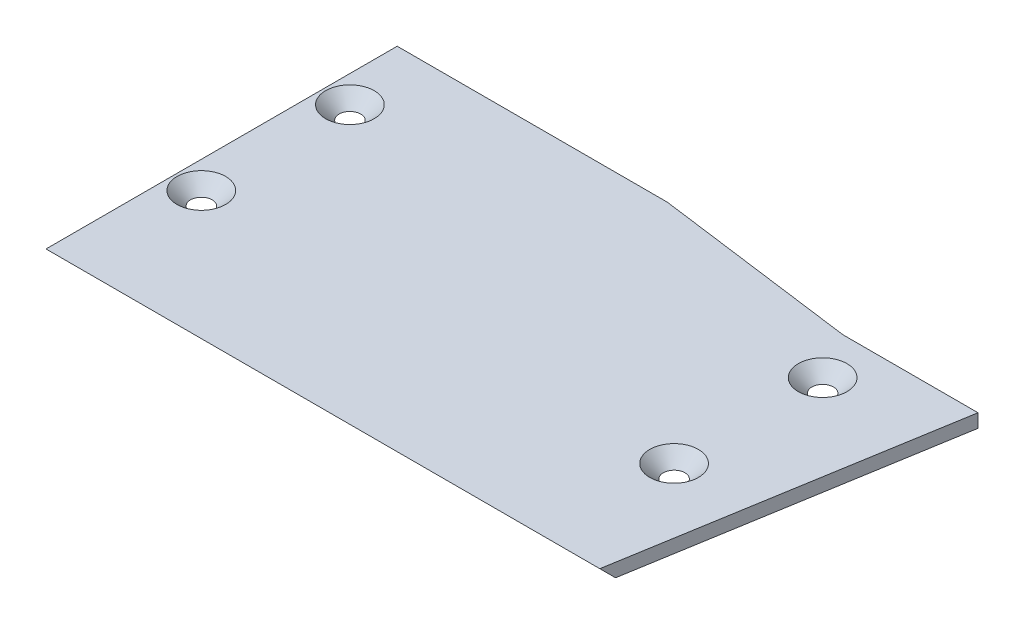
ISO-10303-21;
HEADER;
FILE_DESCRIPTION(('STEP AP214'),'2;1');
FILE_NAME('part.step','',(''),(''),'','','');
FILE_SCHEMA(('AUTOMOTIVE_DESIGN { 1 0 10303 214 1 1 1 1 }'));
ENDSEC;
DATA;
#1=APPLICATION_CONTEXT('core data for automotive mechanical design processes');
#2=APPLICATION_PROTOCOL_DEFINITION('international standard','automotive_design',2000,#1);
#3=PRODUCT_CONTEXT('',#1,'mechanical');
#4=PRODUCT('Part','Part','',(#3));
#5=PRODUCT_RELATED_PRODUCT_CATEGORY('part','',(#4));
#6=PRODUCT_DEFINITION_FORMATION('','',#4);
#7=PRODUCT_DEFINITION_CONTEXT('part definition',#1,'design');
#8=PRODUCT_DEFINITION('design','',#6,#7);
#9=PRODUCT_DEFINITION_SHAPE('','',#8);
#10=(LENGTH_UNIT() NAMED_UNIT(*) SI_UNIT(.MILLI.,.METRE.));
#11=(NAMED_UNIT(*) PLANE_ANGLE_UNIT() SI_UNIT($,.RADIAN.));
#12=(NAMED_UNIT(*) SI_UNIT($,.STERADIAN.) SOLID_ANGLE_UNIT());
#13=UNCERTAINTY_MEASURE_WITH_UNIT(LENGTH_MEASURE(1.E-05),#10,'distance_accuracy_value','');
#14=(GEOMETRIC_REPRESENTATION_CONTEXT(3) GLOBAL_UNCERTAINTY_ASSIGNED_CONTEXT((#13)) GLOBAL_UNIT_ASSIGNED_CONTEXT((#10,
#11,#12)) REPRESENTATION_CONTEXT('',''));
#15=CARTESIAN_POINT('',(0.,0.,0.));
#16=DIRECTION('',(0.,0.,1.));
#17=DIRECTION('',(1.,0.,0.));
#18=AXIS2_PLACEMENT_3D('',#15,#16,#17);
#19=CARTESIAN_POINT('',(90.,2.,0.));
#20=DIRECTION('',(-0.986393923832144,0.,-0.164398987305357));
#21=DIRECTION('',(-0.164398987305357,0.,0.986393923832144));
#22=AXIS2_PLACEMENT_3D('',#19,#20,#21);
#23=PLANE('',#22);
#24=DIRECTION('',(0.164398987305357,0.,-0.986393923832144));
#25=VECTOR('',#24,1.);
#26=CARTESIAN_POINT('',(90.,2.,0.));
#27=LINE('',#26,#25);
#28=CARTESIAN_POINT('',(82.,2.,48.));
#29=VERTEX_POINT('',#28);
#30=CARTESIAN_POINT('',(90.,2.,0.));
#31=VERTEX_POINT('',#30);
#32=EDGE_CURVE('E109',#29,#31,#27,.T.);
#33=ORIENTED_EDGE('',*,*,#32,.F.);
#34=DIRECTION('',(0.117041147196131,-0.702246883176784,-0.702246883176783));
#35=VECTOR('',#34,1.);
#36=CARTESIAN_POINT('',(82.,2.,48.));
#37=LINE('',#36,#35);
#38=CARTESIAN_POINT('',(82.3333333333333,0.,46.));
#39=VERTEX_POINT('',#38);
#40=EDGE_CURVE('E59',#29,#39,#37,.T.);
#41=ORIENTED_EDGE('',*,*,#40,.T.);
#42=DIRECTION('',(0.164398987305357,0.,-0.986393923832144));
#43=VECTOR('',#42,1.);
#44=CARTESIAN_POINT('',(90.,0.,0.));
#45=LINE('',#44,#43);
#46=CARTESIAN_POINT('',(90.,0.,0.));
#47=VERTEX_POINT('',#46);
#48=EDGE_CURVE('E120',#39,#47,#45,.T.);
#49=ORIENTED_EDGE('',*,*,#48,.T.);
#50=DIRECTION('',(0.,-1.,0.));
#51=VECTOR('',#50,1.);
#52=CARTESIAN_POINT('',(90.,2.,0.));
#53=LINE('',#52,#51);
#54=EDGE_CURVE('E137',#31,#47,#53,.T.);
#55=ORIENTED_EDGE('',*,*,#54,.F.);
#56=EDGE_LOOP('',(#33,#41,#49,#55));
#57=FACE_BOUND('',#56,.T.);
#58=ADVANCED_FACE('F35',(#57),#23,.F.);
#59=CARTESIAN_POINT('',(70.,2.,0.));
#60=DIRECTION('',(0.,0.,1.));
#61=DIRECTION('',(1.,0.,0.));
#62=AXIS2_PLACEMENT_3D('',#59,#60,#61);
#63=PLANE('',#62);
#64=DIRECTION('',(-1.,0.,0.));
#65=VECTOR('',#64,1.);
#66=CARTESIAN_POINT('',(70.,0.,0.));
#67=LINE('',#66,#65);
#68=CARTESIAN_POINT('',(70.,0.,0.));
#69=VERTEX_POINT('',#68);
#70=EDGE_CURVE('E122',#47,#69,#67,.T.);
#71=ORIENTED_EDGE('',*,*,#70,.T.);
#72=DIRECTION('',(0.,-1.,0.));
#73=VECTOR('',#72,1.);
#74=CARTESIAN_POINT('',(70.,2.,0.));
#75=LINE('',#74,#73);
#76=CARTESIAN_POINT('',(70.,2.,0.));
#77=VERTEX_POINT('',#76);
#78=EDGE_CURVE('E134',#77,#69,#75,.T.);
#79=ORIENTED_EDGE('',*,*,#78,.F.);
#80=DIRECTION('',(-1.,0.,0.));
#81=VECTOR('',#80,1.);
#82=CARTESIAN_POINT('',(70.,2.,0.));
#83=LINE('',#82,#81);
#84=EDGE_CURVE('E111',#31,#77,#83,.T.);
#85=ORIENTED_EDGE('',*,*,#84,.F.);
#86=ORIENTED_EDGE('',*,*,#54,.T.);
#87=EDGE_LOOP('',(#71,#79,#85,#86));
#88=FACE_BOUND('',#87,.T.);
#89=ADVANCED_FACE('F182',(#88),#63,.F.);
#90=CARTESIAN_POINT('',(40.,2.,-4.));
#91=DIRECTION('',(-0.132163720091018,0.,0.991227900682635));
#92=DIRECTION('',(0.991227900682635,0.,0.132163720091018));
#93=AXIS2_PLACEMENT_3D('',#90,#91,#92);
#94=PLANE('',#93);
#95=DIRECTION('',(-0.991227900682635,0.,-0.132163720091018));
#96=VECTOR('',#95,1.);
#97=CARTESIAN_POINT('',(40.,0.,-4.));
#98=LINE('',#97,#96);
#99=CARTESIAN_POINT('',(40.,0.,-4.));
#100=VERTEX_POINT('',#99);
#101=EDGE_CURVE('E125',#69,#100,#98,.T.);
#102=ORIENTED_EDGE('',*,*,#101,.T.);
#103=DIRECTION('',(0.,-1.,0.));
#104=VECTOR('',#103,1.);
#105=CARTESIAN_POINT('',(40.,2.,-4.));
#106=LINE('',#105,#104);
#107=CARTESIAN_POINT('',(40.,2.,-4.));
#108=VERTEX_POINT('',#107);
#109=EDGE_CURVE('E131',#108,#100,#106,.T.);
#110=ORIENTED_EDGE('',*,*,#109,.F.);
#111=DIRECTION('',(-0.991227900682635,0.,-0.132163720091018));
#112=VECTOR('',#111,1.);
#113=CARTESIAN_POINT('',(40.,2.,-4.));
#114=LINE('',#113,#112);
#115=EDGE_CURVE('E116',#77,#108,#114,.T.);
#116=ORIENTED_EDGE('',*,*,#115,.F.);
#117=ORIENTED_EDGE('',*,*,#78,.T.);
#118=EDGE_LOOP('',(#102,#110,#116,#117));
#119=FACE_BOUND('',#118,.T.);
#120=ADVANCED_FACE('F187',(#119),#94,.F.);
#121=CARTESIAN_POINT('',(0.,2.,-4.));
#122=DIRECTION('',(0.,0.,1.));
#123=DIRECTION('',(1.,0.,0.));
#124=AXIS2_PLACEMENT_3D('',#121,#122,#123);
#125=PLANE('',#124);
#126=DIRECTION('',(-1.,0.,0.));
#127=VECTOR('',#126,1.);
#128=CARTESIAN_POINT('',(0.,0.,-4.));
#129=LINE('',#128,#127);
#130=CARTESIAN_POINT('',(0.,0.,-4.));
#131=VERTEX_POINT('',#130);
#132=EDGE_CURVE('E127',#100,#131,#129,.T.);
#133=ORIENTED_EDGE('',*,*,#132,.T.);
#134=DIRECTION('',(0.,-1.,0.));
#135=VECTOR('',#134,1.);
#136=CARTESIAN_POINT('',(0.,2.,-4.));
#137=LINE('',#136,#135);
#138=CARTESIAN_POINT('',(0.,2.,-4.));
#139=VERTEX_POINT('',#138);
#140=EDGE_CURVE('E119',#139,#131,#137,.T.);
#141=ORIENTED_EDGE('',*,*,#140,.F.);
#142=DIRECTION('',(-1.,0.,0.));
#143=VECTOR('',#142,1.);
#144=CARTESIAN_POINT('',(0.,2.,-4.));
#145=LINE('',#144,#143);
#146=EDGE_CURVE('E105',#108,#139,#145,.T.);
#147=ORIENTED_EDGE('',*,*,#146,.F.);
#148=ORIENTED_EDGE('',*,*,#109,.T.);
#149=EDGE_LOOP('',(#133,#141,#147,#148));
#150=FACE_BOUND('',#149,.T.);
#151=ADVANCED_FACE('F226',(#150),#125,.F.);
#152=CARTESIAN_POINT('',(0.,2.,0.));
#153=DIRECTION('',(1.,0.,0.));
#154=DIRECTION('',(0.,0.,-1.));
#155=AXIS2_PLACEMENT_3D('',#152,#153,#154);
#156=PLANE('',#155);
#157=DIRECTION('',(0.,0.,1.));
#158=VECTOR('',#157,1.);
#159=CARTESIAN_POINT('',(0.,0.,0.));
#160=LINE('',#159,#158);
#161=CARTESIAN_POINT('',(0.,0.,46.));
#162=VERTEX_POINT('',#161);
#163=EDGE_CURVE('E95',#131,#162,#160,.T.);
#164=ORIENTED_EDGE('',*,*,#163,.T.);
#165=DIRECTION('',(0.,0.707106781186548,0.707106781186547));
#166=VECTOR('',#165,1.);
#167=CARTESIAN_POINT('',(0.,2.,48.));
#168=LINE('',#167,#166);
#169=CARTESIAN_POINT('',(0.,2.,48.));
#170=VERTEX_POINT('',#169);
#171=EDGE_CURVE('E89',#162,#170,#168,.T.);
#172=ORIENTED_EDGE('',*,*,#171,.T.);
#173=DIRECTION('',(0.,0.,1.));
#174=VECTOR('',#173,1.);
#175=CARTESIAN_POINT('',(0.,2.,48.));
#176=LINE('',#175,#174);
#177=EDGE_CURVE('E93',#139,#170,#176,.T.);
#178=ORIENTED_EDGE('',*,*,#177,.F.);
#179=ORIENTED_EDGE('',*,*,#140,.T.);
#180=EDGE_LOOP('',(#164,#172,#178,#179));
#181=FACE_BOUND('',#180,.T.);
#182=ADVANCED_FACE('F91',(#181),#156,.F.);
#183=CARTESIAN_POINT('',(0.,2.,0.));
#184=DIRECTION('',(0.,-1.,0.));
#185=DIRECTION('',(0.,0.,-1.));
#186=AXIS2_PLACEMENT_3D('',#183,#184,#185);
#187=PLANE('',#186);
#188=CARTESIAN_POINT('',(74.,2.,7.));
#189=DIRECTION('',(0.,-1.,0.));
#190=DIRECTION('',(0.,0.,-1.));
#191=AXIS2_PLACEMENT_3D('',#188,#189,#190);
#192=CIRCLE('',#191,3.60000000000003);
#193=CARTESIAN_POINT('',(74.,2.,3.39999999999997));
#194=VERTEX_POINT('',#193);
#195=EDGE_CURVE('E11',#194,#194,#192,.T.);
#196=ORIENTED_EDGE('',*,*,#195,.T.);
#197=EDGE_LOOP('',(#196));
#198=FACE_BOUND('',#197,.T.);
#199=CARTESIAN_POINT('',(74.,2.,29.));
#200=DIRECTION('',(0.,-1.,0.));
#201=DIRECTION('',(0.,0.,-1.));
#202=AXIS2_PLACEMENT_3D('',#199,#200,#201);
#203=CIRCLE('',#202,3.60000000000003);
#204=CARTESIAN_POINT('',(74.,2.,25.4));
#205=VERTEX_POINT('',#204);
#206=EDGE_CURVE('E44',#205,#205,#203,.T.);
#207=ORIENTED_EDGE('',*,*,#206,.T.);
#208=EDGE_LOOP('',(#207));
#209=FACE_BOUND('',#208,.T.);
#210=CARTESIAN_POINT('',(4.,2.,7.));
#211=DIRECTION('',(0.,-1.,0.));
#212=DIRECTION('',(0.,0.,-1.));
#213=AXIS2_PLACEMENT_3D('',#210,#211,#212);
#214=CIRCLE('',#213,3.60000000000002);
#215=CARTESIAN_POINT('',(4.,2.,3.39999999999998));
#216=VERTEX_POINT('',#215);
#217=EDGE_CURVE('E144',#216,#216,#214,.T.);
#218=ORIENTED_EDGE('',*,*,#217,.T.);
#219=EDGE_LOOP('',(#218));
#220=FACE_BOUND('',#219,.T.);
#221=CARTESIAN_POINT('',(4.00000000000001,2.,29.));
#222=DIRECTION('',(0.,-1.,0.));
#223=DIRECTION('',(0.,0.,-1.));
#224=AXIS2_PLACEMENT_3D('',#221,#222,#223);
#225=CIRCLE('',#224,3.60000000000003);
#226=CARTESIAN_POINT('',(4.00000000000001,2.,25.4));
#227=VERTEX_POINT('',#226);
#228=EDGE_CURVE('E98',#227,#227,#225,.T.);
#229=ORIENTED_EDGE('',*,*,#228,.T.);
#230=EDGE_LOOP('',(#229));
#231=FACE_BOUND('',#230,.T.);
#232=ORIENTED_EDGE('',*,*,#177,.T.);
#233=DIRECTION('',(1.,0.,0.));
#234=VECTOR('',#233,1.);
#235=CARTESIAN_POINT('',(82.,2.,48.));
#236=LINE('',#235,#234);
#237=EDGE_CURVE('E103',#170,#29,#236,.T.);
#238=ORIENTED_EDGE('',*,*,#237,.T.);
#239=ORIENTED_EDGE('',*,*,#32,.T.);
#240=ORIENTED_EDGE('',*,*,#84,.T.);
#241=ORIENTED_EDGE('',*,*,#115,.T.);
#242=ORIENTED_EDGE('',*,*,#146,.T.);
#243=EDGE_LOOP('',(#232,#238,#239,#240,#241,#242));
#244=FACE_BOUND('',#243,.T.);
#245=ADVANCED_FACE('F102',(#198,#209,#220,#231,#244),#187,.F.);
#246=CARTESIAN_POINT('',(0.,0.,0.));
#247=DIRECTION('',(0.,-1.,0.));
#248=DIRECTION('',(0.,0.,-1.));
#249=AXIS2_PLACEMENT_3D('',#246,#247,#248);
#250=PLANE('',#249);
#251=CARTESIAN_POINT('',(4.00000000000001,0.,29.));
#252=DIRECTION('',(0.,1.,0.));
#253=DIRECTION('',(0.,0.,1.));
#254=AXIS2_PLACEMENT_3D('',#251,#252,#253);
#255=CIRCLE('',#254,1.6);
#256=CARTESIAN_POINT('',(4.00000000000001,0.,30.6));
#257=VERTEX_POINT('',#256);
#258=EDGE_CURVE('E164',#257,#257,#255,.T.);
#259=ORIENTED_EDGE('',*,*,#258,.T.);
#260=EDGE_LOOP('',(#259));
#261=FACE_BOUND('',#260,.T.);
#262=CARTESIAN_POINT('',(74.,0.,7.));
#263=DIRECTION('',(0.,1.,0.));
#264=DIRECTION('',(0.,0.,1.));
#265=AXIS2_PLACEMENT_3D('',#262,#263,#264);
#266=CIRCLE('',#265,1.60000000000001);
#267=CARTESIAN_POINT('',(74.,0.,8.6));
#268=VERTEX_POINT('',#267);
#269=EDGE_CURVE('E161',#268,#268,#266,.T.);
#270=ORIENTED_EDGE('',*,*,#269,.T.);
#271=EDGE_LOOP('',(#270));
#272=FACE_BOUND('',#271,.T.);
#273=CARTESIAN_POINT('',(74.,0.,29.));
#274=DIRECTION('',(0.,1.,0.));
#275=DIRECTION('',(0.,0.,1.));
#276=AXIS2_PLACEMENT_3D('',#273,#274,#275);
#277=CIRCLE('',#276,1.6);
#278=CARTESIAN_POINT('',(74.,0.,30.6));
#279=VERTEX_POINT('',#278);
#280=EDGE_CURVE('E159',#279,#279,#277,.T.);
#281=ORIENTED_EDGE('',*,*,#280,.T.);
#282=EDGE_LOOP('',(#281));
#283=FACE_BOUND('',#282,.T.);
#284=CARTESIAN_POINT('',(4.,0.,7.));
#285=DIRECTION('',(0.,1.,0.));
#286=DIRECTION('',(0.,0.,1.));
#287=AXIS2_PLACEMENT_3D('',#284,#285,#286);
#288=CIRCLE('',#287,1.6);
#289=CARTESIAN_POINT('',(4.,0.,8.6));
#290=VERTEX_POINT('',#289);
#291=EDGE_CURVE('E123',#290,#290,#288,.T.);
#292=ORIENTED_EDGE('',*,*,#291,.T.);
#293=EDGE_LOOP('',(#292));
#294=FACE_BOUND('',#293,.T.);
#295=ORIENTED_EDGE('',*,*,#48,.F.);
#296=DIRECTION('',(-1.,0.,0.));
#297=VECTOR('',#296,1.);
#298=CARTESIAN_POINT('',(0.,0.,46.));
#299=LINE('',#298,#297);
#300=EDGE_CURVE('E51',#39,#162,#299,.T.);
#301=ORIENTED_EDGE('',*,*,#300,.T.);
#302=ORIENTED_EDGE('',*,*,#163,.F.);
#303=ORIENTED_EDGE('',*,*,#132,.F.);
#304=ORIENTED_EDGE('',*,*,#101,.F.);
#305=ORIENTED_EDGE('',*,*,#70,.F.);
#306=EDGE_LOOP('',(#295,#301,#302,#303,#304,#305));
#307=FACE_BOUND('',#306,.T.);
#308=ADVANCED_FACE('F171',(#261,#272,#283,#294,#307),#250,.T.);
#309=CARTESIAN_POINT('',(82.,2.,48.));
#310=DIRECTION('',(0.,-0.707106781186547,0.707106781186548));
#311=DIRECTION('',(-1.,0.,0.));
#312=AXIS2_PLACEMENT_3D('',#309,#310,#311);
#313=PLANE('',#312);
#314=ORIENTED_EDGE('',*,*,#171,.F.);
#315=ORIENTED_EDGE('',*,*,#300,.F.);
#316=ORIENTED_EDGE('',*,*,#40,.F.);
#317=ORIENTED_EDGE('',*,*,#237,.F.);
#318=EDGE_LOOP('',(#314,#315,#316,#317));
#319=FACE_BOUND('',#318,.T.);
#320=ADVANCED_FACE('F108',(#319),#313,.T.);
#321=CARTESIAN_POINT('',(74.,0.,7.));
#322=DIRECTION('',(0.,1.,0.));
#323=DIRECTION('',(0.,0.,1.));
#324=AXIS2_PLACEMENT_3D('',#321,#322,#323);
#325=CONICAL_SURFACE('',#324,1.60000000000001,0.785398163397454);
#326=ORIENTED_EDGE('',*,*,#195,.F.);
#327=EDGE_LOOP('',(#326));
#328=FACE_BOUND('',#327,.T.);
#329=ORIENTED_EDGE('',*,*,#269,.F.);
#330=EDGE_LOOP('',(#329));
#331=FACE_BOUND('',#330,.T.);
#332=ADVANCED_FACE('F155',(#328,#331),#325,.F.);
#333=CARTESIAN_POINT('',(74.,0.,29.));
#334=DIRECTION('',(0.,1.,0.));
#335=DIRECTION('',(0.,0.,1.));
#336=AXIS2_PLACEMENT_3D('',#333,#334,#335);
#337=CONICAL_SURFACE('',#336,1.6,0.785398163397454);
#338=ORIENTED_EDGE('',*,*,#206,.F.);
#339=EDGE_LOOP('',(#338));
#340=FACE_BOUND('',#339,.T.);
#341=ORIENTED_EDGE('',*,*,#280,.F.);
#342=EDGE_LOOP('',(#341));
#343=FACE_BOUND('',#342,.T.);
#344=ADVANCED_FACE('F151',(#340,#343),#337,.F.);
#345=CARTESIAN_POINT('',(4.,0.,7.));
#346=DIRECTION('',(0.,1.,0.));
#347=DIRECTION('',(0.,0.,1.));
#348=AXIS2_PLACEMENT_3D('',#345,#346,#347);
#349=CONICAL_SURFACE('',#348,1.6,0.78539816339745);
#350=ORIENTED_EDGE('',*,*,#217,.F.);
#351=EDGE_LOOP('',(#350));
#352=FACE_BOUND('',#351,.T.);
#353=ORIENTED_EDGE('',*,*,#291,.F.);
#354=EDGE_LOOP('',(#353));
#355=FACE_BOUND('',#354,.T.);
#356=ADVANCED_FACE('F154',(#352,#355),#349,.F.);
#357=CARTESIAN_POINT('',(4.00000000000001,0.,29.));
#358=DIRECTION('',(0.,1.,0.));
#359=DIRECTION('',(0.,0.,1.));
#360=AXIS2_PLACEMENT_3D('',#357,#358,#359);
#361=CONICAL_SURFACE('',#360,1.6,0.785398163397454);
#362=ORIENTED_EDGE('',*,*,#228,.F.);
#363=EDGE_LOOP('',(#362));
#364=FACE_BOUND('',#363,.T.);
#365=ORIENTED_EDGE('',*,*,#258,.F.);
#366=EDGE_LOOP('',(#365));
#367=FACE_BOUND('',#366,.T.);
#368=ADVANCED_FACE('F38',(#364,#367),#361,.F.);
#369=CLOSED_SHELL('',(#58,#89,#120,#151,#182,#245,#308,#320,#332,#344,#356,#368));
#370=MANIFOLD_SOLID_BREP('B2',#369);
#371=ADVANCED_BREP_SHAPE_REPRESENTATION('',(#18,#370),#14);
#372=SHAPE_DEFINITION_REPRESENTATION(#9,#371);
ENDSEC;
END-ISO-10303-21;
